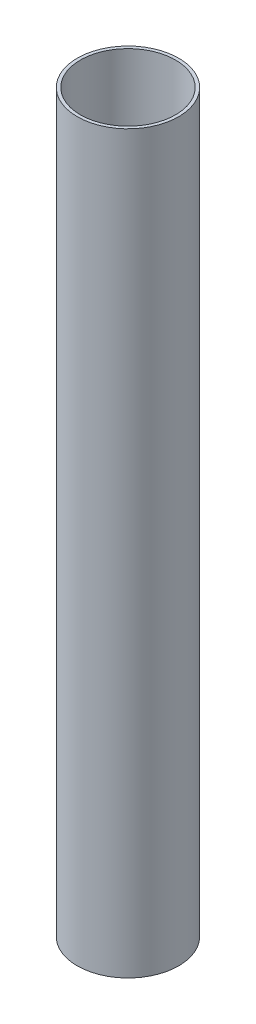
ISO-10303-21;
HEADER;
FILE_DESCRIPTION(('STEP AP214'),'2;1');
FILE_NAME('part.step','',(''),(''),'','','');
FILE_SCHEMA(('AUTOMOTIVE_DESIGN { 1 0 10303 214 1 1 1 1 }'));
ENDSEC;
DATA;
#1=APPLICATION_CONTEXT('core data for automotive mechanical design processes');
#2=APPLICATION_PROTOCOL_DEFINITION('international standard','automotive_design',2000,#1);
#3=PRODUCT_CONTEXT('',#1,'mechanical');
#4=PRODUCT('Part','Part','',(#3));
#5=PRODUCT_RELATED_PRODUCT_CATEGORY('part','',(#4));
#6=PRODUCT_DEFINITION_FORMATION('','',#4);
#7=PRODUCT_DEFINITION_CONTEXT('part definition',#1,'design');
#8=PRODUCT_DEFINITION('design','',#6,#7);
#9=PRODUCT_DEFINITION_SHAPE('','',#8);
#10=(LENGTH_UNIT() NAMED_UNIT(*) SI_UNIT(.MILLI.,.METRE.));
#11=(NAMED_UNIT(*) PLANE_ANGLE_UNIT() SI_UNIT($,.RADIAN.));
#12=(NAMED_UNIT(*) SI_UNIT($,.STERADIAN.) SOLID_ANGLE_UNIT());
#13=UNCERTAINTY_MEASURE_WITH_UNIT(LENGTH_MEASURE(1.E-05),#10,'distance_accuracy_value','');
#14=(GEOMETRIC_REPRESENTATION_CONTEXT(3) GLOBAL_UNCERTAINTY_ASSIGNED_CONTEXT((#13)) GLOBAL_UNIT_ASSIGNED_CONTEXT((#10,
#11,#12)) REPRESENTATION_CONTEXT('',''));
#15=CARTESIAN_POINT('',(0.,0.,0.));
#16=DIRECTION('',(0.,0.,1.));
#17=DIRECTION('',(1.,0.,0.));
#18=AXIS2_PLACEMENT_3D('',#15,#16,#17);
#19=CARTESIAN_POINT('',(0.,232.,0.));
#20=DIRECTION('',(0.,1.,0.));
#21=DIRECTION('',(0.,0.,1.));
#22=AXIS2_PLACEMENT_3D('',#19,#20,#21);
#23=PLANE('',#22);
#24=CARTESIAN_POINT('',(0.,232.,0.));
#25=DIRECTION('',(0.,1.,0.));
#26=DIRECTION('',(0.,0.,1.));
#27=AXIS2_PLACEMENT_3D('',#24,#25,#26);
#28=CIRCLE('',#27,16.);
#29=CARTESIAN_POINT('',(0.,232.,16.));
#30=VERTEX_POINT('',#29);
#31=EDGE_CURVE('E11',#30,#30,#28,.T.);
#32=ORIENTED_EDGE('',*,*,#31,.T.);
#33=EDGE_LOOP('',(#32));
#34=FACE_BOUND('',#33,.T.);
#35=CARTESIAN_POINT('',(0.,232.,0.));
#36=DIRECTION('',(0.,1.,0.));
#37=DIRECTION('',(0.,0.,1.));
#38=AXIS2_PLACEMENT_3D('',#35,#36,#37);
#39=CIRCLE('',#38,15.);
#40=CARTESIAN_POINT('',(0.,232.,15.));
#41=VERTEX_POINT('',#40);
#42=EDGE_CURVE('E48',#41,#41,#39,.T.);
#43=ORIENTED_EDGE('',*,*,#42,.F.);
#44=EDGE_LOOP('',(#43));
#45=FACE_BOUND('',#44,.T.);
#46=ADVANCED_FACE('F37',(#34,#45),#23,.T.);
#47=CARTESIAN_POINT('',(0.,0.,0.));
#48=DIRECTION('',(0.,1.,0.));
#49=DIRECTION('',(0.,0.,1.));
#50=AXIS2_PLACEMENT_3D('',#47,#48,#49);
#51=PLANE('',#50);
#52=CARTESIAN_POINT('',(0.,0.,0.));
#53=DIRECTION('',(0.,1.,0.));
#54=DIRECTION('',(0.,0.,1.));
#55=AXIS2_PLACEMENT_3D('',#52,#53,#54);
#56=CIRCLE('',#55,16.);
#57=CARTESIAN_POINT('',(0.,0.,16.));
#58=VERTEX_POINT('',#57);
#59=EDGE_CURVE('E41',#58,#58,#56,.T.);
#60=ORIENTED_EDGE('',*,*,#59,.F.);
#61=EDGE_LOOP('',(#60));
#62=FACE_BOUND('',#61,.T.);
#63=CARTESIAN_POINT('',(0.,0.,0.));
#64=DIRECTION('',(0.,1.,0.));
#65=DIRECTION('',(0.,0.,1.));
#66=AXIS2_PLACEMENT_3D('',#63,#64,#65);
#67=CIRCLE('',#66,15.);
#68=CARTESIAN_POINT('',(0.,0.,15.));
#69=VERTEX_POINT('',#68);
#70=EDGE_CURVE('E50',#69,#69,#67,.T.);
#71=ORIENTED_EDGE('',*,*,#70,.T.);
#72=EDGE_LOOP('',(#71));
#73=FACE_BOUND('',#72,.T.);
#74=ADVANCED_FACE('F60',(#62,#73),#51,.F.);
#75=CARTESIAN_POINT('',(0.,232.,0.));
#76=DIRECTION('',(0.,-1.,0.));
#77=DIRECTION('',(0.,0.,-1.));
#78=AXIS2_PLACEMENT_3D('',#75,#76,#77);
#79=CYLINDRICAL_SURFACE('',#78,16.);
#80=ORIENTED_EDGE('',*,*,#31,.F.);
#81=EDGE_LOOP('',(#80));
#82=FACE_BOUND('',#81,.T.);
#83=ORIENTED_EDGE('',*,*,#59,.T.);
#84=EDGE_LOOP('',(#83));
#85=FACE_BOUND('',#84,.T.);
#86=ADVANCED_FACE('F39',(#82,#85),#79,.T.);
#87=CARTESIAN_POINT('',(0.,232.,0.));
#88=DIRECTION('',(0.,-1.,0.));
#89=DIRECTION('',(0.,0.,-1.));
#90=AXIS2_PLACEMENT_3D('',#87,#88,#89);
#91=CYLINDRICAL_SURFACE('',#90,15.);
#92=ORIENTED_EDGE('',*,*,#42,.T.);
#93=EDGE_LOOP('',(#92));
#94=FACE_BOUND('',#93,.T.);
#95=ORIENTED_EDGE('',*,*,#70,.F.);
#96=EDGE_LOOP('',(#95));
#97=FACE_BOUND('',#96,.T.);
#98=ADVANCED_FACE('F56',(#94,#97),#91,.F.);
#99=CLOSED_SHELL('',(#46,#74,#86,#98));
#100=MANIFOLD_SOLID_BREP('B2',#99);
#101=ADVANCED_BREP_SHAPE_REPRESENTATION('',(#18,#100),#14);
#102=SHAPE_DEFINITION_REPRESENTATION(#9,#101);
ENDSEC;
END-ISO-10303-21;
